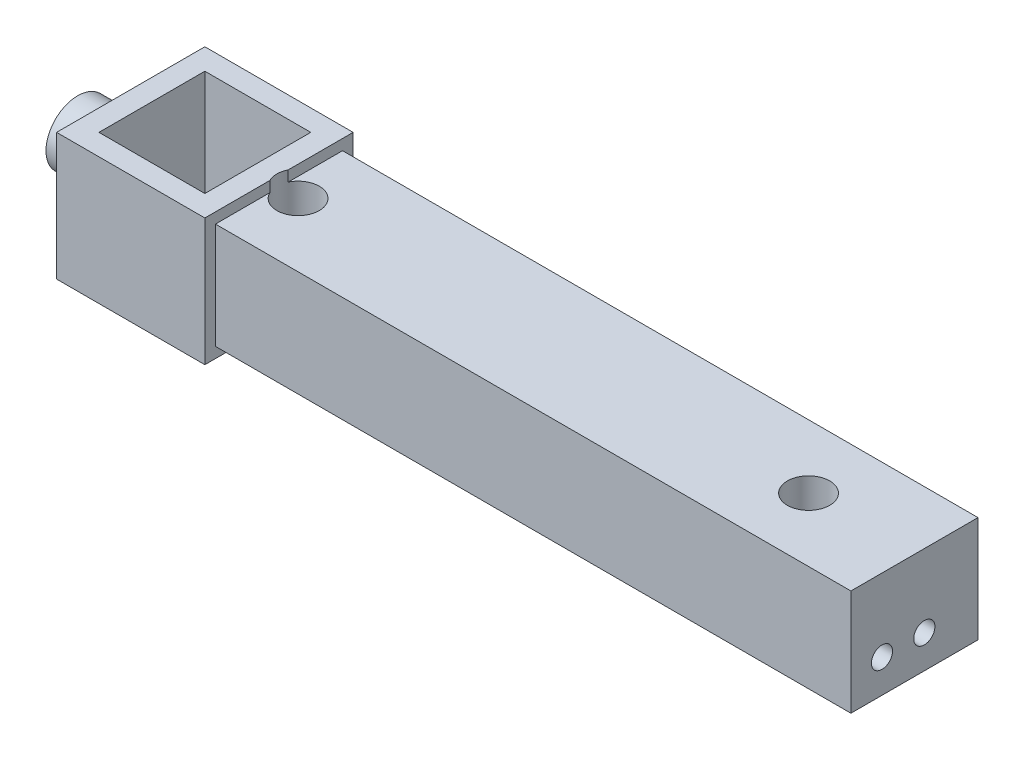
ISO-10303-21;
HEADER;
FILE_DESCRIPTION(('STEP AP214'),'2;1');
FILE_NAME('part.step','',(''),(''),'','','');
FILE_SCHEMA(('AUTOMOTIVE_DESIGN { 1 0 10303 214 1 1 1 1 }'));
ENDSEC;
DATA;
#1=APPLICATION_CONTEXT('core data for automotive mechanical design processes');
#2=APPLICATION_PROTOCOL_DEFINITION('international standard','automotive_design',2000,#1);
#3=PRODUCT_CONTEXT('',#1,'mechanical');
#4=PRODUCT('Part','Part','',(#3));
#5=PRODUCT_RELATED_PRODUCT_CATEGORY('part','',(#4));
#6=PRODUCT_DEFINITION_FORMATION('','',#4);
#7=PRODUCT_DEFINITION_CONTEXT('part definition',#1,'design');
#8=PRODUCT_DEFINITION('design','',#6,#7);
#9=PRODUCT_DEFINITION_SHAPE('','',#8);
#10=(LENGTH_UNIT() NAMED_UNIT(*) SI_UNIT(.MILLI.,.METRE.));
#11=(NAMED_UNIT(*) PLANE_ANGLE_UNIT() SI_UNIT($,.RADIAN.));
#12=(NAMED_UNIT(*) SI_UNIT($,.STERADIAN.) SOLID_ANGLE_UNIT());
#13=UNCERTAINTY_MEASURE_WITH_UNIT(LENGTH_MEASURE(1.E-05),#10,'distance_accuracy_value','');
#14=(GEOMETRIC_REPRESENTATION_CONTEXT(3) GLOBAL_UNCERTAINTY_ASSIGNED_CONTEXT((#13)) GLOBAL_UNIT_ASSIGNED_CONTEXT((#10,
#11,#12)) REPRESENTATION_CONTEXT('',''));
#15=CARTESIAN_POINT('',(0.,0.,0.));
#16=DIRECTION('',(0.,0.,1.));
#17=DIRECTION('',(1.,0.,0.));
#18=AXIS2_PLACEMENT_3D('',#15,#16,#17);
#19=CARTESIAN_POINT('',(35.,60.,35.));
#20=DIRECTION('',(-1.,0.,0.));
#21=DIRECTION('',(0.,0.,1.));
#22=AXIS2_PLACEMENT_3D('',#19,#20,#21);
#23=PLANE('',#22);
#24=DIRECTION('',(0.,0.,-1.));
#25=VECTOR('',#24,1.);
#26=CARTESIAN_POINT('',(35.,0.,35.));
#27=LINE('',#26,#25);
#28=CARTESIAN_POINT('',(35.,0.,35.));
#29=VERTEX_POINT('',#28);
#30=CARTESIAN_POINT('',(35.,0.,4.35889894354068));
#31=VERTEX_POINT('',#30);
#32=EDGE_CURVE('E186',#29,#31,#27,.T.);
#33=ORIENTED_EDGE('',*,*,#32,.T.);
#34=DIRECTION('',(0.,1.,0.));
#35=VECTOR('',#34,1.);
#36=CARTESIAN_POINT('',(35.,0.,4.35889894354068));
#37=LINE('',#36,#35);
#38=CARTESIAN_POINT('',(35.,4.99999999999999,4.35889894354068));
#39=VERTEX_POINT('',#38);
#40=EDGE_CURVE('E160',#31,#39,#37,.T.);
#41=ORIENTED_EDGE('',*,*,#40,.T.);
#42=DIRECTION('',(0.,0.,-1.));
#43=VECTOR('',#42,1.);
#44=CARTESIAN_POINT('',(35.,5.,-30.));
#45=LINE('',#44,#43);
#46=CARTESIAN_POINT('',(35.,4.99999999999999,30.));
#47=VERTEX_POINT('',#46);
#48=EDGE_CURVE('E246',#47,#39,#45,.T.);
#49=ORIENTED_EDGE('',*,*,#48,.F.);
#50=DIRECTION('',(0.,-1.,0.));
#51=VECTOR('',#50,1.);
#52=CARTESIAN_POINT('',(35.,4.99999999999999,30.));
#53=LINE('',#52,#51);
#54=CARTESIAN_POINT('',(35.,55.,30.));
#55=VERTEX_POINT('',#54);
#56=EDGE_CURVE('E242',#55,#47,#53,.T.);
#57=ORIENTED_EDGE('',*,*,#56,.F.);
#58=DIRECTION('',(0.,0.,1.));
#59=VECTOR('',#58,1.);
#60=CARTESIAN_POINT('',(35.,55.,-30.));
#61=LINE('',#60,#59);
#62=CARTESIAN_POINT('',(35.,55.,4.35889894354068));
#63=VERTEX_POINT('',#62);
#64=EDGE_CURVE('E254',#63,#55,#61,.T.);
#65=ORIENTED_EDGE('',*,*,#64,.F.);
#66=CARTESIAN_POINT('',(35.,60.,4.35889894354068));
#67=VERTEX_POINT('',#66);
#68=EDGE_CURVE('E70',#63,#67,#37,.T.);
#69=ORIENTED_EDGE('',*,*,#68,.T.);
#70=DIRECTION('',(0.,0.,-1.));
#71=VECTOR('',#70,1.);
#72=CARTESIAN_POINT('',(35.,60.,35.));
#73=LINE('',#72,#71);
#74=CARTESIAN_POINT('',(35.,60.,35.));
#75=VERTEX_POINT('',#74);
#76=EDGE_CURVE('E319',#75,#67,#73,.T.);
#77=ORIENTED_EDGE('',*,*,#76,.F.);
#78=DIRECTION('',(0.,-1.,0.));
#79=VECTOR('',#78,1.);
#80=CARTESIAN_POINT('',(35.,60.,35.));
#81=LINE('',#80,#79);
#82=EDGE_CURVE('E213',#75,#29,#81,.T.);
#83=ORIENTED_EDGE('',*,*,#82,.T.);
#84=EDGE_LOOP('',(#33,#41,#49,#57,#65,#69,#77,#83));
#85=FACE_BOUND('',#84,.T.);
#86=ADVANCED_FACE('F46',(#85),#23,.F.);
#87=CARTESIAN_POINT('',(35.,60.,-4.35889894354067));
#88=VERTEX_POINT('',#87);
#89=CARTESIAN_POINT('',(35.,60.,-35.));
#90=VERTEX_POINT('',#89);
#91=EDGE_CURVE('E318',#88,#90,#73,.T.);
#92=ORIENTED_EDGE('',*,*,#91,.F.);
#93=DIRECTION('',(0.,1.,0.));
#94=VECTOR('',#93,1.);
#95=CARTESIAN_POINT('',(35.,0.,-4.35889894354067));
#96=LINE('',#95,#94);
#97=CARTESIAN_POINT('',(35.,55.,-4.35889894354067));
#98=VERTEX_POINT('',#97);
#99=EDGE_CURVE('E165',#88,#98,#96,.F.);
#100=ORIENTED_EDGE('',*,*,#99,.T.);
#101=CARTESIAN_POINT('',(35.,55.,-30.));
#102=VERTEX_POINT('',#101);
#103=EDGE_CURVE('E232',#102,#98,#61,.T.);
#104=ORIENTED_EDGE('',*,*,#103,.F.);
#105=DIRECTION('',(0.,1.,0.));
#106=VECTOR('',#105,1.);
#107=CARTESIAN_POINT('',(35.,5.,-30.));
#108=LINE('',#107,#106);
#109=CARTESIAN_POINT('',(35.,5.,-30.));
#110=VERTEX_POINT('',#109);
#111=EDGE_CURVE('E250',#110,#102,#108,.T.);
#112=ORIENTED_EDGE('',*,*,#111,.F.);
#113=CARTESIAN_POINT('',(35.,4.99999999999999,-4.35889894354067));
#114=VERTEX_POINT('',#113);
#115=EDGE_CURVE('E176',#114,#110,#45,.T.);
#116=ORIENTED_EDGE('',*,*,#115,.F.);
#117=CARTESIAN_POINT('',(35.,0.,-4.35889894354067));
#118=VERTEX_POINT('',#117);
#119=EDGE_CURVE('E62',#114,#118,#96,.F.);
#120=ORIENTED_EDGE('',*,*,#119,.T.);
#121=CARTESIAN_POINT('',(35.,0.,-35.));
#122=VERTEX_POINT('',#121);
#123=EDGE_CURVE('E173',#118,#122,#27,.T.);
#124=ORIENTED_EDGE('',*,*,#123,.T.);
#125=DIRECTION('',(0.,-1.,0.));
#126=VECTOR('',#125,1.);
#127=CARTESIAN_POINT('',(35.,60.,-35.));
#128=LINE('',#127,#126);
#129=EDGE_CURVE('E211',#90,#122,#128,.T.);
#130=ORIENTED_EDGE('',*,*,#129,.F.);
#131=EDGE_LOOP('',(#92,#100,#104,#112,#116,#120,#124,#130));
#132=FACE_BOUND('',#131,.T.);
#133=ADVANCED_FACE('F171',(#132),#23,.F.);
#134=CARTESIAN_POINT('',(0.,60.,0.));
#135=DIRECTION('',(0.,-1.,0.));
#136=DIRECTION('',(0.,0.,-1.));
#137=AXIS2_PLACEMENT_3D('',#134,#135,#136);
#138=PLANE('',#137);
#139=ORIENTED_EDGE('',*,*,#76,.T.);
#140=CARTESIAN_POINT('',(44.,60.,0.));
#141=DIRECTION('',(0.,1.,0.));
#142=DIRECTION('',(0.,0.,1.));
#143=AXIS2_PLACEMENT_3D('',#140,#141,#142);
#144=CIRCLE('',#143,9.99999999999999);
#145=EDGE_CURVE('E166',#88,#67,#144,.T.);
#146=ORIENTED_EDGE('',*,*,#145,.F.);
#147=ORIENTED_EDGE('',*,*,#91,.T.);
#148=DIRECTION('',(-1.,0.,0.));
#149=VECTOR('',#148,1.);
#150=CARTESIAN_POINT('',(35.,60.,-35.));
#151=LINE('',#150,#149);
#152=CARTESIAN_POINT('',(-35.,60.,-35.));
#153=VERTEX_POINT('',#152);
#154=EDGE_CURVE('E323',#90,#153,#151,.T.);
#155=ORIENTED_EDGE('',*,*,#154,.T.);
#156=DIRECTION('',(0.,0.,1.));
#157=VECTOR('',#156,1.);
#158=CARTESIAN_POINT('',(-35.,60.,35.));
#159=LINE('',#158,#157);
#160=CARTESIAN_POINT('',(-35.,60.,35.));
#161=VERTEX_POINT('',#160);
#162=EDGE_CURVE('E207',#153,#161,#159,.T.);
#163=ORIENTED_EDGE('',*,*,#162,.T.);
#164=DIRECTION('',(1.,0.,0.));
#165=VECTOR('',#164,1.);
#166=CARTESIAN_POINT('',(35.,60.,35.));
#167=LINE('',#166,#165);
#168=EDGE_CURVE('E201',#161,#75,#167,.T.);
#169=ORIENTED_EDGE('',*,*,#168,.T.);
#170=EDGE_LOOP('',(#139,#146,#147,#155,#163,#169));
#171=FACE_BOUND('',#170,.T.);
#172=DIRECTION('',(0.,0.,1.));
#173=VECTOR('',#172,1.);
#174=CARTESIAN_POINT('',(-25.,60.,25.));
#175=LINE('',#174,#173);
#176=CARTESIAN_POINT('',(-25.,60.,-25.));
#177=VERTEX_POINT('',#176);
#178=CARTESIAN_POINT('',(-25.,60.,25.));
#179=VERTEX_POINT('',#178);
#180=EDGE_CURVE('E274',#177,#179,#175,.T.);
#181=ORIENTED_EDGE('',*,*,#180,.F.);
#182=DIRECTION('',(-1.,0.,0.));
#183=VECTOR('',#182,1.);
#184=CARTESIAN_POINT('',(25.,60.,-25.));
#185=LINE('',#184,#183);
#186=CARTESIAN_POINT('',(25.,60.,-25.));
#187=VERTEX_POINT('',#186);
#188=EDGE_CURVE('E285',#187,#177,#185,.T.);
#189=ORIENTED_EDGE('',*,*,#188,.F.);
#190=DIRECTION('',(0.,0.,-1.));
#191=VECTOR('',#190,1.);
#192=CARTESIAN_POINT('',(25.,60.,25.));
#193=LINE('',#192,#191);
#194=CARTESIAN_POINT('',(25.,60.,25.));
#195=VERTEX_POINT('',#194);
#196=EDGE_CURVE('E281',#195,#187,#193,.T.);
#197=ORIENTED_EDGE('',*,*,#196,.F.);
#198=DIRECTION('',(1.,0.,0.));
#199=VECTOR('',#198,1.);
#200=CARTESIAN_POINT('',(25.,60.,25.));
#201=LINE('',#200,#199);
#202=EDGE_CURVE('E277',#179,#195,#201,.T.);
#203=ORIENTED_EDGE('',*,*,#202,.F.);
#204=EDGE_LOOP('',(#181,#189,#197,#203));
#205=FACE_BOUND('',#204,.T.);
#206=ADVANCED_FACE('F329',(#171,#205),#138,.F.);
#207=CARTESIAN_POINT('',(0.,0.,0.));
#208=DIRECTION('',(0.,-1.,0.));
#209=DIRECTION('',(0.,0.,-1.));
#210=AXIS2_PLACEMENT_3D('',#207,#208,#209);
#211=PLANE('',#210);
#212=CARTESIAN_POINT('',(44.,0.,0.));
#213=DIRECTION('',(0.,1.,0.));
#214=DIRECTION('',(0.,0.,1.));
#215=AXIS2_PLACEMENT_3D('',#212,#213,#214);
#216=CIRCLE('',#215,9.99999999999999);
#217=EDGE_CURVE('E157',#118,#31,#216,.T.);
#218=ORIENTED_EDGE('',*,*,#217,.T.);
#219=ORIENTED_EDGE('',*,*,#32,.F.);
#220=DIRECTION('',(1.,0.,0.));
#221=VECTOR('',#220,1.);
#222=CARTESIAN_POINT('',(35.,0.,35.));
#223=LINE('',#222,#221);
#224=CARTESIAN_POINT('',(-35.,0.,35.));
#225=VERTEX_POINT('',#224);
#226=EDGE_CURVE('E187',#225,#29,#223,.T.);
#227=ORIENTED_EDGE('',*,*,#226,.F.);
#228=DIRECTION('',(0.,0.,1.));
#229=VECTOR('',#228,1.);
#230=CARTESIAN_POINT('',(-35.,0.,35.));
#231=LINE('',#230,#229);
#232=CARTESIAN_POINT('',(-35.,0.,-35.));
#233=VERTEX_POINT('',#232);
#234=EDGE_CURVE('E198',#233,#225,#231,.T.);
#235=ORIENTED_EDGE('',*,*,#234,.F.);
#236=DIRECTION('',(-1.,0.,0.));
#237=VECTOR('',#236,1.);
#238=CARTESIAN_POINT('',(35.,0.,-35.));
#239=LINE('',#238,#237);
#240=EDGE_CURVE('E184',#122,#233,#239,.T.);
#241=ORIENTED_EDGE('',*,*,#240,.F.);
#242=ORIENTED_EDGE('',*,*,#123,.F.);
#243=EDGE_LOOP('',(#218,#219,#227,#235,#241,#242));
#244=FACE_BOUND('',#243,.T.);
#245=DIRECTION('',(-1.,0.,0.));
#246=VECTOR('',#245,1.);
#247=CARTESIAN_POINT('',(25.,0.,-25.));
#248=LINE('',#247,#246);
#249=CARTESIAN_POINT('',(25.,0.,-25.));
#250=VERTEX_POINT('',#249);
#251=CARTESIAN_POINT('',(-25.,0.,-25.));
#252=VERTEX_POINT('',#251);
#253=EDGE_CURVE('E278',#250,#252,#248,.T.);
#254=ORIENTED_EDGE('',*,*,#253,.T.);
#255=DIRECTION('',(0.,0.,1.));
#256=VECTOR('',#255,1.);
#257=CARTESIAN_POINT('',(-25.,0.,25.));
#258=LINE('',#257,#256);
#259=CARTESIAN_POINT('',(-25.,0.,25.));
#260=VERTEX_POINT('',#259);
#261=EDGE_CURVE('E273',#252,#260,#258,.T.);
#262=ORIENTED_EDGE('',*,*,#261,.T.);
#263=DIRECTION('',(1.,0.,0.));
#264=VECTOR('',#263,1.);
#265=CARTESIAN_POINT('',(25.,0.,25.));
#266=LINE('',#265,#264);
#267=CARTESIAN_POINT('',(25.,0.,25.));
#268=VERTEX_POINT('',#267);
#269=EDGE_CURVE('E292',#260,#268,#266,.T.);
#270=ORIENTED_EDGE('',*,*,#269,.T.);
#271=DIRECTION('',(0.,0.,-1.));
#272=VECTOR('',#271,1.);
#273=CARTESIAN_POINT('',(25.,0.,25.));
#274=LINE('',#273,#272);
#275=EDGE_CURVE('E296',#268,#250,#274,.T.);
#276=ORIENTED_EDGE('',*,*,#275,.T.);
#277=EDGE_LOOP('',(#254,#262,#270,#276));
#278=FACE_BOUND('',#277,.T.);
#279=ADVANCED_FACE('F181',(#244,#278),#211,.T.);
#280=CARTESIAN_POINT('',(35.,60.,35.));
#281=DIRECTION('',(0.,0.,-1.));
#282=DIRECTION('',(-1.,0.,0.));
#283=AXIS2_PLACEMENT_3D('',#280,#281,#282);
#284=PLANE('',#283);
#285=ORIENTED_EDGE('',*,*,#226,.T.);
#286=ORIENTED_EDGE('',*,*,#82,.F.);
#287=ORIENTED_EDGE('',*,*,#168,.F.);
#288=DIRECTION('',(0.,-1.,0.));
#289=VECTOR('',#288,1.);
#290=CARTESIAN_POINT('',(-35.,60.,35.));
#291=LINE('',#290,#289);
#292=EDGE_CURVE('E202',#161,#225,#291,.T.);
#293=ORIENTED_EDGE('',*,*,#292,.T.);
#294=EDGE_LOOP('',(#285,#286,#287,#293));
#295=FACE_BOUND('',#294,.T.);
#296=ADVANCED_FACE('F48',(#295),#284,.F.);
#297=CARTESIAN_POINT('',(35.,60.,-35.));
#298=DIRECTION('',(0.,0.,1.));
#299=DIRECTION('',(1.,0.,0.));
#300=AXIS2_PLACEMENT_3D('',#297,#298,#299);
#301=PLANE('',#300);
#302=ORIENTED_EDGE('',*,*,#240,.T.);
#303=DIRECTION('',(0.,-1.,0.));
#304=VECTOR('',#303,1.);
#305=CARTESIAN_POINT('',(-35.,60.,-35.));
#306=LINE('',#305,#304);
#307=EDGE_CURVE('E206',#153,#233,#306,.T.);
#308=ORIENTED_EDGE('',*,*,#307,.F.);
#309=ORIENTED_EDGE('',*,*,#154,.F.);
#310=ORIENTED_EDGE('',*,*,#129,.T.);
#311=EDGE_LOOP('',(#302,#308,#309,#310));
#312=FACE_BOUND('',#311,.T.);
#313=ADVANCED_FACE('F446',(#312),#301,.F.);
#314=CARTESIAN_POINT('',(-35.,60.,35.));
#315=DIRECTION('',(1.,0.,0.));
#316=DIRECTION('',(0.,0.,-1.));
#317=AXIS2_PLACEMENT_3D('',#314,#315,#316);
#318=PLANE('',#317);
#319=CARTESIAN_POINT('',(-35.,30.,0.));
#320=DIRECTION('',(-1.,0.,0.));
#321=DIRECTION('',(0.,0.,1.));
#322=AXIS2_PLACEMENT_3D('',#319,#320,#321);
#323=CIRCLE('',#322,15.);
#324=CARTESIAN_POINT('',(-35.,30.,15.));
#325=VERTEX_POINT('',#324);
#326=EDGE_CURVE('E55',#325,#325,#323,.T.);
#327=ORIENTED_EDGE('',*,*,#326,.F.);
#328=EDGE_LOOP('',(#327));
#329=FACE_BOUND('',#328,.T.);
#330=ORIENTED_EDGE('',*,*,#234,.T.);
#331=ORIENTED_EDGE('',*,*,#292,.F.);
#332=ORIENTED_EDGE('',*,*,#162,.F.);
#333=ORIENTED_EDGE('',*,*,#307,.T.);
#334=EDGE_LOOP('',(#330,#331,#332,#333));
#335=FACE_BOUND('',#334,.T.);
#336=ADVANCED_FACE('F335',(#329,#335),#318,.F.);
#337=CARTESIAN_POINT('',(-25.,60.,25.));
#338=DIRECTION('',(1.,0.,0.));
#339=DIRECTION('',(0.,0.,-1.));
#340=AXIS2_PLACEMENT_3D('',#337,#338,#339);
#341=PLANE('',#340);
#342=ORIENTED_EDGE('',*,*,#261,.F.);
#343=DIRECTION('',(0.,-1.,0.));
#344=VECTOR('',#343,1.);
#345=CARTESIAN_POINT('',(-25.,60.,-25.));
#346=LINE('',#345,#344);
#347=EDGE_CURVE('E288',#177,#252,#346,.T.);
#348=ORIENTED_EDGE('',*,*,#347,.F.);
#349=ORIENTED_EDGE('',*,*,#180,.T.);
#350=DIRECTION('',(0.,-1.,0.));
#351=VECTOR('',#350,1.);
#352=CARTESIAN_POINT('',(-25.,60.,25.));
#353=LINE('',#352,#351);
#354=EDGE_CURVE('E192',#179,#260,#353,.T.);
#355=ORIENTED_EDGE('',*,*,#354,.T.);
#356=EDGE_LOOP('',(#342,#348,#349,#355));
#357=FACE_BOUND('',#356,.T.);
#358=ADVANCED_FACE('F452',(#357),#341,.T.);
#359=CARTESIAN_POINT('',(25.,60.,25.));
#360=DIRECTION('',(0.,0.,-1.));
#361=DIRECTION('',(-1.,0.,0.));
#362=AXIS2_PLACEMENT_3D('',#359,#360,#361);
#363=PLANE('',#362);
#364=ORIENTED_EDGE('',*,*,#269,.F.);
#365=ORIENTED_EDGE('',*,*,#354,.F.);
#366=ORIENTED_EDGE('',*,*,#202,.T.);
#367=DIRECTION('',(0.,-1.,0.));
#368=VECTOR('',#367,1.);
#369=CARTESIAN_POINT('',(25.,60.,25.));
#370=LINE('',#369,#368);
#371=EDGE_CURVE('E309',#195,#268,#370,.T.);
#372=ORIENTED_EDGE('',*,*,#371,.T.);
#373=EDGE_LOOP('',(#364,#365,#366,#372));
#374=FACE_BOUND('',#373,.T.);
#375=ADVANCED_FACE('F460',(#374),#363,.T.);
#376=CARTESIAN_POINT('',(25.,60.,25.));
#377=DIRECTION('',(-1.,0.,0.));
#378=DIRECTION('',(0.,0.,1.));
#379=AXIS2_PLACEMENT_3D('',#376,#377,#378);
#380=PLANE('',#379);
#381=ORIENTED_EDGE('',*,*,#275,.F.);
#382=ORIENTED_EDGE('',*,*,#371,.F.);
#383=ORIENTED_EDGE('',*,*,#196,.T.);
#384=DIRECTION('',(0.,-1.,0.));
#385=VECTOR('',#384,1.);
#386=CARTESIAN_POINT('',(25.,60.,-25.));
#387=LINE('',#386,#385);
#388=EDGE_CURVE('E306',#187,#250,#387,.T.);
#389=ORIENTED_EDGE('',*,*,#388,.T.);
#390=EDGE_LOOP('',(#381,#382,#383,#389));
#391=FACE_BOUND('',#390,.T.);
#392=ADVANCED_FACE('F464',(#391),#380,.T.);
#393=CARTESIAN_POINT('',(25.,60.,-25.));
#394=DIRECTION('',(0.,0.,1.));
#395=DIRECTION('',(1.,0.,0.));
#396=AXIS2_PLACEMENT_3D('',#393,#394,#395);
#397=PLANE('',#396);
#398=ORIENTED_EDGE('',*,*,#253,.F.);
#399=ORIENTED_EDGE('',*,*,#388,.F.);
#400=ORIENTED_EDGE('',*,*,#188,.T.);
#401=ORIENTED_EDGE('',*,*,#347,.T.);
#402=EDGE_LOOP('',(#398,#399,#400,#401));
#403=FACE_BOUND('',#402,.T.);
#404=ADVANCED_FACE('F468',(#403),#397,.T.);
#405=CARTESIAN_POINT('',(335.,4.99999999999999,30.));
#406=DIRECTION('',(0.,0.,-1.));
#407=DIRECTION('',(-1.,0.,0.));
#408=AXIS2_PLACEMENT_3D('',#405,#406,#407);
#409=PLANE('',#408);
#410=ORIENTED_EDGE('',*,*,#56,.T.);
#411=DIRECTION('',(-1.,0.,0.));
#412=VECTOR('',#411,1.);
#413=CARTESIAN_POINT('',(335.,4.99999999999999,30.));
#414=LINE('',#413,#412);
#415=CARTESIAN_POINT('',(335.,4.99999999999999,30.));
#416=VERTEX_POINT('',#415);
#417=EDGE_CURVE('E269',#416,#47,#414,.T.);
#418=ORIENTED_EDGE('',*,*,#417,.F.);
#419=DIRECTION('',(0.,-1.,0.));
#420=VECTOR('',#419,1.);
#421=CARTESIAN_POINT('',(335.,4.99999999999999,30.));
#422=LINE('',#421,#420);
#423=CARTESIAN_POINT('',(335.,55.,30.));
#424=VERTEX_POINT('',#423);
#425=EDGE_CURVE('E227',#424,#416,#422,.T.);
#426=ORIENTED_EDGE('',*,*,#425,.F.);
#427=DIRECTION('',(-1.,0.,0.));
#428=VECTOR('',#427,1.);
#429=CARTESIAN_POINT('',(335.,55.,30.));
#430=LINE('',#429,#428);
#431=EDGE_CURVE('E241',#424,#55,#430,.T.);
#432=ORIENTED_EDGE('',*,*,#431,.T.);
#433=EDGE_LOOP('',(#410,#418,#426,#432));
#434=FACE_BOUND('',#433,.T.);
#435=ADVANCED_FACE('F348',(#434),#409,.F.);
#436=CARTESIAN_POINT('',(335.,5.,-30.));
#437=DIRECTION('',(0.,1.,0.));
#438=DIRECTION('',(0.,0.,1.));
#439=AXIS2_PLACEMENT_3D('',#436,#437,#438);
#440=PLANE('',#439);
#441=CARTESIAN_POINT('',(255.000023190432,4.99999999999999,0.0373018145608256));
#442=DIRECTION('',(0.,1.,0.));
#443=DIRECTION('',(0.,0.,1.));
#444=AXIS2_PLACEMENT_3D('',#441,#442,#443);
#445=CIRCLE('',#444,2.50000000000002);
#446=CARTESIAN_POINT('',(255.000023190432,4.99999999999999,2.53730181456085));
#447=VERTEX_POINT('',#446);
#448=EDGE_CURVE('E369',#447,#447,#445,.F.);
#449=ORIENTED_EDGE('',*,*,#448,.F.);
#450=EDGE_LOOP('',(#449));
#451=FACE_BOUND('',#450,.T.);
#452=CARTESIAN_POINT('',(299.967684085767,5.,-25.9993929373106));
#453=DIRECTION('',(0.,1.,0.));
#454=DIRECTION('',(0.,0.,1.));
#455=AXIS2_PLACEMENT_3D('',#452,#453,#454);
#456=CIRCLE('',#455,2.50000000000008);
#457=CARTESIAN_POINT('',(299.967684085767,5.,-23.4993929373105));
#458=VERTEX_POINT('',#457);
#459=EDGE_CURVE('E381',#458,#458,#456,.F.);
#460=ORIENTED_EDGE('',*,*,#459,.F.);
#461=EDGE_LOOP('',(#460));
#462=FACE_BOUND('',#461,.T.);
#463=CARTESIAN_POINT('',(300.032292723801,4.99999999999999,25.9620911227497));
#464=DIRECTION('',(0.,1.,0.));
#465=DIRECTION('',(0.,0.,1.));
#466=AXIS2_PLACEMENT_3D('',#463,#464,#465);
#467=CIRCLE('',#466,2.50000000000008);
#468=CARTESIAN_POINT('',(300.032292723801,4.99999999999999,28.4620911227497));
#469=VERTEX_POINT('',#468);
#470=EDGE_CURVE('E389',#469,#469,#467,.F.);
#471=ORIENTED_EDGE('',*,*,#470,.F.);
#472=EDGE_LOOP('',(#471));
#473=FACE_BOUND('',#472,.T.);
#474=CARTESIAN_POINT('',(285.,4.99999999999999,0.));
#475=DIRECTION('',(0.,1.,0.));
#476=DIRECTION('',(0.,0.,1.));
#477=AXIS2_PLACEMENT_3D('',#474,#475,#476);
#478=CIRCLE('',#477,10.);
#479=CARTESIAN_POINT('',(285.,4.99999999999999,10.));
#480=VERTEX_POINT('',#479);
#481=EDGE_CURVE('E357',#480,#480,#478,.T.);
#482=ORIENTED_EDGE('',*,*,#481,.T.);
#483=EDGE_LOOP('',(#482));
#484=FACE_BOUND('',#483,.T.);
#485=ORIENTED_EDGE('',*,*,#48,.T.);
#486=CARTESIAN_POINT('',(44.,4.99999999999999,0.));
#487=DIRECTION('',(0.,1.,0.));
#488=DIRECTION('',(0.,0.,1.));
#489=AXIS2_PLACEMENT_3D('',#486,#487,#488);
#490=CIRCLE('',#489,9.99999999999999);
#491=EDGE_CURVE('E178',#39,#114,#490,.T.);
#492=ORIENTED_EDGE('',*,*,#491,.T.);
#493=ORIENTED_EDGE('',*,*,#115,.T.);
#494=DIRECTION('',(-1.,0.,0.));
#495=VECTOR('',#494,1.);
#496=CARTESIAN_POINT('',(335.,5.,-30.));
#497=LINE('',#496,#495);
#498=CARTESIAN_POINT('',(335.,5.,-30.));
#499=VERTEX_POINT('',#498);
#500=EDGE_CURVE('E265',#499,#110,#497,.T.);
#501=ORIENTED_EDGE('',*,*,#500,.F.);
#502=DIRECTION('',(0.,0.,-1.));
#503=VECTOR('',#502,1.);
#504=CARTESIAN_POINT('',(335.,5.,-30.));
#505=LINE('',#504,#503);
#506=EDGE_CURVE('E231',#416,#499,#505,.T.);
#507=ORIENTED_EDGE('',*,*,#506,.F.);
#508=ORIENTED_EDGE('',*,*,#417,.T.);
#509=EDGE_LOOP('',(#485,#492,#493,#501,#507,#508));
#510=FACE_BOUND('',#509,.T.);
#511=ADVANCED_FACE('F343',(#451,#462,#473,#484,#510),#440,.F.);
#512=CARTESIAN_POINT('',(335.,5.,-30.));
#513=DIRECTION('',(0.,0.,1.));
#514=DIRECTION('',(1.,0.,0.));
#515=AXIS2_PLACEMENT_3D('',#512,#513,#514);
#516=PLANE('',#515);
#517=ORIENTED_EDGE('',*,*,#111,.T.);
#518=DIRECTION('',(-1.,0.,0.));
#519=VECTOR('',#518,1.);
#520=CARTESIAN_POINT('',(335.,55.,-30.));
#521=LINE('',#520,#519);
#522=CARTESIAN_POINT('',(335.,55.,-30.));
#523=VERTEX_POINT('',#522);
#524=EDGE_CURVE('E261',#523,#102,#521,.T.);
#525=ORIENTED_EDGE('',*,*,#524,.F.);
#526=DIRECTION('',(0.,1.,0.));
#527=VECTOR('',#526,1.);
#528=CARTESIAN_POINT('',(335.,5.,-30.));
#529=LINE('',#528,#527);
#530=EDGE_CURVE('E235',#499,#523,#529,.T.);
#531=ORIENTED_EDGE('',*,*,#530,.F.);
#532=ORIENTED_EDGE('',*,*,#500,.T.);
#533=EDGE_LOOP('',(#517,#525,#531,#532));
#534=FACE_BOUND('',#533,.T.);
#535=ADVANCED_FACE('F431',(#534),#516,.F.);
#536=CARTESIAN_POINT('',(335.,55.,-30.));
#537=DIRECTION('',(0.,-1.,0.));
#538=DIRECTION('',(0.,0.,-1.));
#539=AXIS2_PLACEMENT_3D('',#536,#537,#538);
#540=PLANE('',#539);
#541=CARTESIAN_POINT('',(285.,55.,0.));
#542=DIRECTION('',(0.,1.,0.));
#543=DIRECTION('',(0.,0.,1.));
#544=AXIS2_PLACEMENT_3D('',#541,#542,#543);
#545=CIRCLE('',#544,10.);
#546=CARTESIAN_POINT('',(285.,55.,10.));
#547=VERTEX_POINT('',#546);
#548=EDGE_CURVE('E340',#547,#547,#545,.T.);
#549=ORIENTED_EDGE('',*,*,#548,.F.);
#550=EDGE_LOOP('',(#549));
#551=FACE_BOUND('',#550,.T.);
#552=ORIENTED_EDGE('',*,*,#103,.T.);
#553=CARTESIAN_POINT('',(44.,55.,0.));
#554=DIRECTION('',(0.,-1.,0.));
#555=DIRECTION('',(0.,0.,-1.));
#556=AXIS2_PLACEMENT_3D('',#553,#554,#555);
#557=CIRCLE('',#556,9.99999999999999);
#558=EDGE_CURVE('E11',#98,#63,#557,.T.);
#559=ORIENTED_EDGE('',*,*,#558,.T.);
#560=ORIENTED_EDGE('',*,*,#64,.T.);
#561=ORIENTED_EDGE('',*,*,#431,.F.);
#562=DIRECTION('',(0.,0.,1.));
#563=VECTOR('',#562,1.);
#564=CARTESIAN_POINT('',(335.,55.,-30.));
#565=LINE('',#564,#563);
#566=EDGE_CURVE('E238',#523,#424,#565,.T.);
#567=ORIENTED_EDGE('',*,*,#566,.F.);
#568=ORIENTED_EDGE('',*,*,#524,.T.);
#569=EDGE_LOOP('',(#552,#559,#560,#561,#567,#568));
#570=FACE_BOUND('',#569,.T.);
#571=ADVANCED_FACE('F424',(#551,#570),#540,.F.);
#572=CARTESIAN_POINT('',(335.,0.,0.));
#573=DIRECTION('',(1.,0.,0.));
#574=DIRECTION('',(0.,0.,-1.));
#575=AXIS2_PLACEMENT_3D('',#572,#573,#574);
#576=PLANE('',#575);
#577=CARTESIAN_POINT('',(335.,20.6050887660178,15.3404830777123));
#578=DIRECTION('',(1.,0.,0.));
#579=DIRECTION('',(0.,0.,-1.));
#580=AXIS2_PLACEMENT_3D('',#577,#578,#579);
#581=CIRCLE('',#580,5.);
#582=CARTESIAN_POINT('',(335.,20.6050887660178,10.3404830777123));
#583=VERTEX_POINT('',#582);
#584=EDGE_CURVE('E397',#583,#583,#581,.T.);
#585=ORIENTED_EDGE('',*,*,#584,.F.);
#586=EDGE_LOOP('',(#585));
#587=FACE_BOUND('',#586,.T.);
#588=CARTESIAN_POINT('',(335.,20.6050887660178,-4.65951692228769));
#589=DIRECTION('',(1.,0.,0.));
#590=DIRECTION('',(0.,0.,-1.));
#591=AXIS2_PLACEMENT_3D('',#588,#589,#590);
#592=CIRCLE('',#591,5.);
#593=CARTESIAN_POINT('',(335.,20.6050887660178,-9.65951692228769));
#594=VERTEX_POINT('',#593);
#595=EDGE_CURVE('E401',#594,#594,#592,.T.);
#596=ORIENTED_EDGE('',*,*,#595,.F.);
#597=EDGE_LOOP('',(#596));
#598=FACE_BOUND('',#597,.T.);
#599=ORIENTED_EDGE('',*,*,#425,.T.);
#600=ORIENTED_EDGE('',*,*,#506,.T.);
#601=ORIENTED_EDGE('',*,*,#530,.T.);
#602=ORIENTED_EDGE('',*,*,#566,.T.);
#603=EDGE_LOOP('',(#599,#600,#601,#602));
#604=FACE_BOUND('',#603,.T.);
#605=ADVANCED_FACE('F420',(#587,#598,#604),#576,.T.);
#606=CARTESIAN_POINT('',(-60.,30.,0.));
#607=DIRECTION('',(1.,0.,0.));
#608=DIRECTION('',(0.,0.,-1.));
#609=AXIS2_PLACEMENT_3D('',#606,#607,#608);
#610=CYLINDRICAL_SURFACE('',#609,15.);
#611=CARTESIAN_POINT('',(-60.,30.,0.));
#612=DIRECTION('',(-1.,0.,0.));
#613=DIRECTION('',(0.,0.,1.));
#614=AXIS2_PLACEMENT_3D('',#611,#612,#613);
#615=CIRCLE('',#614,15.);
#616=CARTESIAN_POINT('',(-60.,30.,15.));
#617=VERTEX_POINT('',#616);
#618=EDGE_CURVE('E225',#617,#617,#615,.T.);
#619=ORIENTED_EDGE('',*,*,#618,.F.);
#620=EDGE_LOOP('',(#619));
#621=FACE_BOUND('',#620,.T.);
#622=ORIENTED_EDGE('',*,*,#326,.T.);
#623=EDGE_LOOP('',(#622));
#624=FACE_BOUND('',#623,.T.);
#625=ADVANCED_FACE('F423',(#621,#624),#610,.T.);
#626=CARTESIAN_POINT('',(-60.,30.,0.));
#627=DIRECTION('',(-1.,0.,0.));
#628=DIRECTION('',(0.,0.,1.));
#629=AXIS2_PLACEMENT_3D('',#626,#627,#628);
#630=PLANE('',#629);
#631=ORIENTED_EDGE('',*,*,#618,.T.);
#632=EDGE_LOOP('',(#631));
#633=FACE_BOUND('',#632,.T.);
#634=ADVANCED_FACE('F489',(#633),#630,.T.);
#635=CARTESIAN_POINT('',(285.,0.,0.));
#636=DIRECTION('',(0.,1.,0.));
#637=DIRECTION('',(0.,0.,1.));
#638=AXIS2_PLACEMENT_3D('',#635,#636,#637);
#639=CYLINDRICAL_SURFACE('',#638,10.);
#640=ORIENTED_EDGE('',*,*,#548,.T.);
#641=EDGE_LOOP('',(#640));
#642=FACE_BOUND('',#641,.T.);
#643=ORIENTED_EDGE('',*,*,#481,.F.);
#644=EDGE_LOOP('',(#643));
#645=FACE_BOUND('',#644,.T.);
#646=ADVANCED_FACE('F487',(#642,#645),#639,.F.);
#647=CARTESIAN_POINT('',(44.,0.,0.));
#648=DIRECTION('',(0.,1.,0.));
#649=DIRECTION('',(0.,0.,1.));
#650=AXIS2_PLACEMENT_3D('',#647,#648,#649);
#651=CYLINDRICAL_SURFACE('',#650,9.99999999999999);
#652=ORIENTED_EDGE('',*,*,#558,.F.);
#653=ORIENTED_EDGE('',*,*,#99,.F.);
#654=ORIENTED_EDGE('',*,*,#145,.T.);
#655=ORIENTED_EDGE('',*,*,#68,.F.);
#656=EDGE_LOOP('',(#652,#653,#654,#655));
#657=FACE_BOUND('',#656,.T.);
#658=ORIENTED_EDGE('',*,*,#217,.F.);
#659=ORIENTED_EDGE('',*,*,#119,.F.);
#660=ORIENTED_EDGE('',*,*,#491,.F.);
#661=ORIENTED_EDGE('',*,*,#40,.F.);
#662=EDGE_LOOP('',(#658,#659,#660,#661));
#663=FACE_BOUND('',#662,.T.);
#664=ADVANCED_FACE('F158',(#657,#663),#651,.F.);
#665=CARTESIAN_POINT('',(300.032292723801,-2.07106781186568,25.9620911227497));
#666=DIRECTION('',(0.,1.,0.));
#667=DIRECTION('',(0.,0.,1.));
#668=AXIS2_PLACEMENT_3D('',#665,#666,#667);
#669=CYLINDRICAL_SURFACE('',#668,2.50000000000008);
#670=ORIENTED_EDGE('',*,*,#470,.T.);
#671=EDGE_LOOP('',(#670));
#672=FACE_BOUND('',#671,.T.);
#673=CARTESIAN_POINT('',(300.032292723801,35.,25.9620911227497));
#674=DIRECTION('',(0.,1.,0.));
#675=DIRECTION('',(0.,0.,1.));
#676=AXIS2_PLACEMENT_3D('',#673,#674,#675);
#677=CIRCLE('',#676,2.50000000000008);
#678=CARTESIAN_POINT('',(300.032292723801,35.,28.4620911227497));
#679=VERTEX_POINT('',#678);
#680=EDGE_CURVE('E385',#679,#679,#677,.T.);
#681=ORIENTED_EDGE('',*,*,#680,.T.);
#682=EDGE_LOOP('',(#681));
#683=FACE_BOUND('',#682,.T.);
#684=ADVANCED_FACE('F496',(#672,#683),#669,.F.);
#685=CARTESIAN_POINT('',(300.032292723801,35.,25.9620911227497));
#686=DIRECTION('',(0.,1.,0.));
#687=DIRECTION('',(0.,0.,1.));
#688=AXIS2_PLACEMENT_3D('',#685,#686,#687);
#689=PLANE('',#688);
#690=ORIENTED_EDGE('',*,*,#680,.F.);
#691=EDGE_LOOP('',(#690));
#692=FACE_BOUND('',#691,.T.);
#693=ADVANCED_FACE('F577',(#692),#689,.F.);
#694=CARTESIAN_POINT('',(299.967684085767,-2.07106781186568,-25.9993929373106));
#695=DIRECTION('',(0.,1.,0.));
#696=DIRECTION('',(0.,0.,1.));
#697=AXIS2_PLACEMENT_3D('',#694,#695,#696);
#698=CYLINDRICAL_SURFACE('',#697,2.50000000000008);
#699=ORIENTED_EDGE('',*,*,#459,.T.);
#700=EDGE_LOOP('',(#699));
#701=FACE_BOUND('',#700,.T.);
#702=CARTESIAN_POINT('',(299.967684085767,35.,-25.9993929373106));
#703=DIRECTION('',(0.,1.,0.));
#704=DIRECTION('',(0.,0.,1.));
#705=AXIS2_PLACEMENT_3D('',#702,#703,#704);
#706=CIRCLE('',#705,2.50000000000008);
#707=CARTESIAN_POINT('',(299.967684085767,35.,-23.4993929373105));
#708=VERTEX_POINT('',#707);
#709=EDGE_CURVE('E377',#708,#708,#706,.T.);
#710=ORIENTED_EDGE('',*,*,#709,.T.);
#711=EDGE_LOOP('',(#710));
#712=FACE_BOUND('',#711,.T.);
#713=ADVANCED_FACE('F588',(#701,#712),#698,.F.);
#714=CARTESIAN_POINT('',(299.967684085767,35.,-25.9993929373106));
#715=DIRECTION('',(0.,1.,0.));
#716=DIRECTION('',(0.,0.,1.));
#717=AXIS2_PLACEMENT_3D('',#714,#715,#716);
#718=PLANE('',#717);
#719=ORIENTED_EDGE('',*,*,#709,.F.);
#720=EDGE_LOOP('',(#719));
#721=FACE_BOUND('',#720,.T.);
#722=ADVANCED_FACE('F598',(#721),#718,.F.);
#723=CARTESIAN_POINT('',(255.000023190432,-2.07106781186568,0.0373018145608248));
#724=DIRECTION('',(0.,1.,0.));
#725=DIRECTION('',(0.,0.,1.));
#726=AXIS2_PLACEMENT_3D('',#723,#724,#725);
#727=CYLINDRICAL_SURFACE('',#726,2.50000000000002);
#728=ORIENTED_EDGE('',*,*,#448,.T.);
#729=EDGE_LOOP('',(#728));
#730=FACE_BOUND('',#729,.T.);
#731=CARTESIAN_POINT('',(255.000023190432,35.,0.0373018145608291));
#732=DIRECTION('',(0.,1.,0.));
#733=DIRECTION('',(0.,0.,1.));
#734=AXIS2_PLACEMENT_3D('',#731,#732,#733);
#735=CIRCLE('',#734,2.50000000000002);
#736=CARTESIAN_POINT('',(255.000023190432,35.,2.53730181456085));
#737=VERTEX_POINT('',#736);
#738=EDGE_CURVE('E373',#737,#737,#735,.T.);
#739=ORIENTED_EDGE('',*,*,#738,.T.);
#740=EDGE_LOOP('',(#739));
#741=FACE_BOUND('',#740,.T.);
#742=ADVANCED_FACE('F609',(#730,#741),#727,.F.);
#743=CARTESIAN_POINT('',(255.000023190432,35.,0.0373018145608291));
#744=DIRECTION('',(0.,1.,0.));
#745=DIRECTION('',(0.,0.,1.));
#746=AXIS2_PLACEMENT_3D('',#743,#744,#745);
#747=PLANE('',#746);
#748=ORIENTED_EDGE('',*,*,#738,.F.);
#749=EDGE_LOOP('',(#748));
#750=FACE_BOUND('',#749,.T.);
#751=ADVANCED_FACE('F416',(#750),#747,.F.);
#752=CARTESIAN_POINT('',(318.,20.6050887660178,-4.65951692228769));
#753=DIRECTION('',(1.,0.,0.));
#754=DIRECTION('',(0.,0.,-1.));
#755=AXIS2_PLACEMENT_3D('',#752,#753,#754);
#756=CYLINDRICAL_SURFACE('',#755,5.);
#757=CARTESIAN_POINT('',(318.,20.6050887660178,-4.65951692228769));
#758=DIRECTION('',(1.,0.,0.));
#759=DIRECTION('',(0.,0.,-1.));
#760=AXIS2_PLACEMENT_3D('',#757,#758,#759);
#761=CIRCLE('',#760,5.);
#762=CARTESIAN_POINT('',(318.,20.6050887660178,-9.65951692228769));
#763=VERTEX_POINT('',#762);
#764=EDGE_CURVE('E405',#763,#763,#761,.T.);
#765=ORIENTED_EDGE('',*,*,#764,.F.);
#766=EDGE_LOOP('',(#765));
#767=FACE_BOUND('',#766,.T.);
#768=ORIENTED_EDGE('',*,*,#595,.T.);
#769=EDGE_LOOP('',(#768));
#770=FACE_BOUND('',#769,.T.);
#771=ADVANCED_FACE('F413',(#767,#770),#756,.F.);
#772=CARTESIAN_POINT('',(318.,20.6050887660178,-4.65951692228769));
#773=DIRECTION('',(1.,0.,0.));
#774=DIRECTION('',(0.,0.,-1.));
#775=AXIS2_PLACEMENT_3D('',#772,#773,#774);
#776=PLANE('',#775);
#777=ORIENTED_EDGE('',*,*,#764,.T.);
#778=EDGE_LOOP('',(#777));
#779=FACE_BOUND('',#778,.T.);
#780=ADVANCED_FACE('F411',(#779),#776,.T.);
#781=CARTESIAN_POINT('',(318.,20.6050887660178,15.3404830777123));
#782=DIRECTION('',(1.,0.,0.));
#783=DIRECTION('',(0.,0.,-1.));
#784=AXIS2_PLACEMENT_3D('',#781,#782,#783);
#785=CYLINDRICAL_SURFACE('',#784,5.);
#786=CARTESIAN_POINT('',(318.,20.6050887660178,15.3404830777123));
#787=DIRECTION('',(1.,0.,0.));
#788=DIRECTION('',(0.,0.,-1.));
#789=AXIS2_PLACEMENT_3D('',#786,#787,#788);
#790=CIRCLE('',#789,5.);
#791=CARTESIAN_POINT('',(318.,20.6050887660178,10.3404830777123));
#792=VERTEX_POINT('',#791);
#793=EDGE_CURVE('E393',#792,#792,#790,.T.);
#794=ORIENTED_EDGE('',*,*,#793,.F.);
#795=EDGE_LOOP('',(#794));
#796=FACE_BOUND('',#795,.T.);
#797=ORIENTED_EDGE('',*,*,#584,.T.);
#798=EDGE_LOOP('',(#797));
#799=FACE_BOUND('',#798,.T.);
#800=ADVANCED_FACE('F648',(#796,#799),#785,.F.);
#801=CARTESIAN_POINT('',(318.,20.6050887660178,15.3404830777123));
#802=DIRECTION('',(1.,0.,0.));
#803=DIRECTION('',(0.,0.,-1.));
#804=AXIS2_PLACEMENT_3D('',#801,#802,#803);
#805=PLANE('',#804);
#806=ORIENTED_EDGE('',*,*,#793,.T.);
#807=EDGE_LOOP('',(#806));
#808=FACE_BOUND('',#807,.T.);
#809=ADVANCED_FACE('F658',(#808),#805,.T.);
#810=CLOSED_SHELL('',(#86,#133,#206,#279,#296,#313,#336,#358,#375,#392,#404,#435,#511,#535,#571,
#605,#625,#634,#646,#664,#684,#693,#713,#722,#742,#751,#771,#780,#800,#809));
#811=MANIFOLD_SOLID_BREP('B2',#810);
#812=ADVANCED_BREP_SHAPE_REPRESENTATION('',(#18,#811),#14);
#813=SHAPE_DEFINITION_REPRESENTATION(#9,#812);
ENDSEC;
END-ISO-10303-21;
